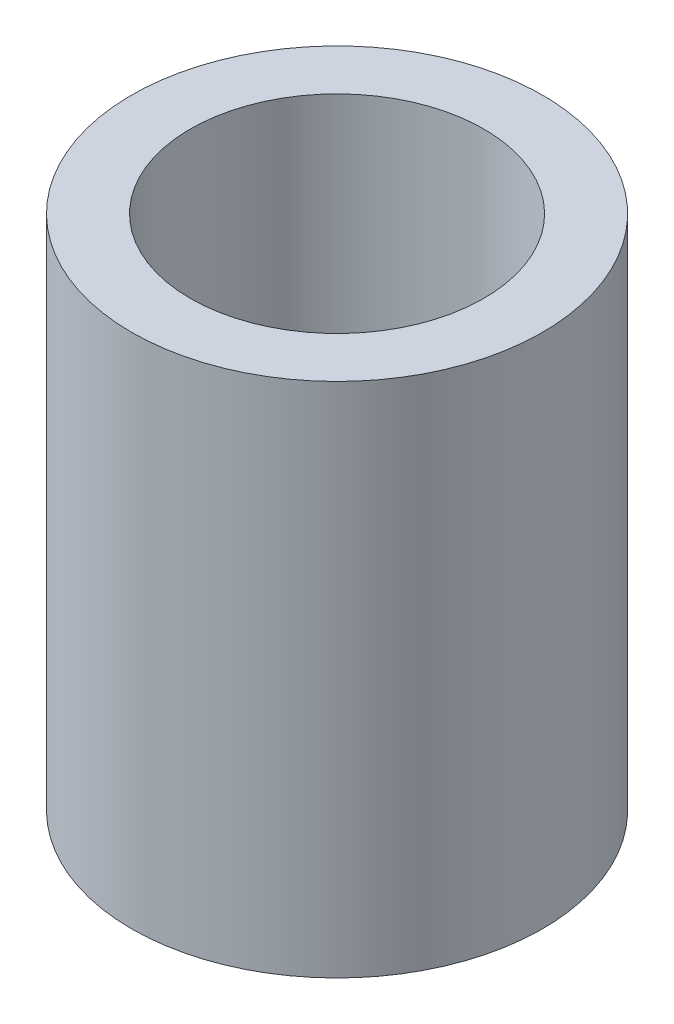
ISO-10303-21;
HEADER;
FILE_DESCRIPTION(('STEP AP214'),'2;1');
FILE_NAME('part.step','',(''),(''),'','','');
FILE_SCHEMA(('AUTOMOTIVE_DESIGN { 1 0 10303 214 1 1 1 1 }'));
ENDSEC;
DATA;
#1=APPLICATION_CONTEXT('core data for automotive mechanical design processes');
#2=APPLICATION_PROTOCOL_DEFINITION('international standard','automotive_design',2000,#1);
#3=PRODUCT_CONTEXT('',#1,'mechanical');
#4=PRODUCT('Part','Part','',(#3));
#5=PRODUCT_RELATED_PRODUCT_CATEGORY('part','',(#4));
#6=PRODUCT_DEFINITION_FORMATION('','',#4);
#7=PRODUCT_DEFINITION_CONTEXT('part definition',#1,'design');
#8=PRODUCT_DEFINITION('design','',#6,#7);
#9=PRODUCT_DEFINITION_SHAPE('','',#8);
#10=(LENGTH_UNIT() NAMED_UNIT(*) SI_UNIT(.MILLI.,.METRE.));
#11=(NAMED_UNIT(*) PLANE_ANGLE_UNIT() SI_UNIT($,.RADIAN.));
#12=(NAMED_UNIT(*) SI_UNIT($,.STERADIAN.) SOLID_ANGLE_UNIT());
#13=UNCERTAINTY_MEASURE_WITH_UNIT(LENGTH_MEASURE(1.E-05),#10,'distance_accuracy_value','');
#14=(GEOMETRIC_REPRESENTATION_CONTEXT(3) GLOBAL_UNCERTAINTY_ASSIGNED_CONTEXT((#13)) GLOBAL_UNIT_ASSIGNED_CONTEXT((#10,
#11,#12)) REPRESENTATION_CONTEXT('',''));
#15=CARTESIAN_POINT('',(0.,0.,0.));
#16=DIRECTION('',(0.,0.,1.));
#17=DIRECTION('',(1.,0.,0.));
#18=AXIS2_PLACEMENT_3D('',#15,#16,#17);
#19=CARTESIAN_POINT('',(0.,-13.97,0.));
#20=DIRECTION('',(0.,1.,0.));
#21=DIRECTION('',(0.,0.,1.));
#22=AXIS2_PLACEMENT_3D('',#19,#20,#21);
#23=CYLINDRICAL_SURFACE('',#22,5.55625);
#24=CARTESIAN_POINT('',(0.,-13.97,0.));
#25=DIRECTION('',(0.,1.,0.));
#26=DIRECTION('',(0.,0.,1.));
#27=AXIS2_PLACEMENT_3D('',#24,#25,#26);
#28=CIRCLE('',#27,5.55625);
#29=CARTESIAN_POINT('',(0.,-13.97,5.55625));
#30=VERTEX_POINT('',#29);
#31=EDGE_CURVE('E10',#30,#30,#28,.T.);
#32=ORIENTED_EDGE('',*,*,#31,.T.);
#33=EDGE_LOOP('',(#32));
#34=FACE_BOUND('',#33,.T.);
#35=CARTESIAN_POINT('',(0.,0.,0.));
#36=DIRECTION('',(0.,1.,0.));
#37=DIRECTION('',(0.,0.,1.));
#38=AXIS2_PLACEMENT_3D('',#35,#36,#37);
#39=CIRCLE('',#38,5.55625);
#40=CARTESIAN_POINT('',(0.,0.,5.55625));
#41=VERTEX_POINT('',#40);
#42=EDGE_CURVE('E40',#41,#41,#39,.T.);
#43=ORIENTED_EDGE('',*,*,#42,.F.);
#44=EDGE_LOOP('',(#43));
#45=FACE_BOUND('',#44,.T.);
#46=ADVANCED_FACE('F37',(#34,#45),#23,.T.);
#47=CARTESIAN_POINT('',(0.,-13.97,0.));
#48=DIRECTION('',(0.,1.,0.));
#49=DIRECTION('',(0.,0.,1.));
#50=AXIS2_PLACEMENT_3D('',#47,#48,#49);
#51=PLANE('',#50);
#52=CARTESIAN_POINT('',(0.,-13.97,0.));
#53=DIRECTION('',(0.,1.,0.));
#54=DIRECTION('',(0.,0.,1.));
#55=AXIS2_PLACEMENT_3D('',#52,#53,#54);
#56=CIRCLE('',#55,3.96875);
#57=CARTESIAN_POINT('',(0.,-13.97,3.96875));
#58=VERTEX_POINT('',#57);
#59=EDGE_CURVE('E49',#58,#58,#56,.T.);
#60=ORIENTED_EDGE('',*,*,#59,.T.);
#61=EDGE_LOOP('',(#60));
#62=FACE_BOUND('',#61,.T.);
#63=ORIENTED_EDGE('',*,*,#31,.F.);
#64=EDGE_LOOP('',(#63));
#65=FACE_BOUND('',#64,.T.);
#66=ADVANCED_FACE('F59',(#62,#65),#51,.F.);
#67=CARTESIAN_POINT('',(0.,0.,0.));
#68=DIRECTION('',(0.,1.,0.));
#69=DIRECTION('',(0.,0.,1.));
#70=AXIS2_PLACEMENT_3D('',#67,#68,#69);
#71=PLANE('',#70);
#72=CARTESIAN_POINT('',(0.,0.,0.));
#73=DIRECTION('',(0.,1.,0.));
#74=DIRECTION('',(0.,0.,1.));
#75=AXIS2_PLACEMENT_3D('',#72,#73,#74);
#76=CIRCLE('',#75,3.96875);
#77=CARTESIAN_POINT('',(0.,0.,3.96875));
#78=VERTEX_POINT('',#77);
#79=EDGE_CURVE('E51',#78,#78,#76,.T.);
#80=ORIENTED_EDGE('',*,*,#79,.F.);
#81=EDGE_LOOP('',(#80));
#82=FACE_BOUND('',#81,.T.);
#83=ORIENTED_EDGE('',*,*,#42,.T.);
#84=EDGE_LOOP('',(#83));
#85=FACE_BOUND('',#84,.T.);
#86=ADVANCED_FACE('F65',(#82,#85),#71,.T.);
#87=CARTESIAN_POINT('',(0.,-13.97,0.));
#88=DIRECTION('',(0.,1.,0.));
#89=DIRECTION('',(0.,0.,1.));
#90=AXIS2_PLACEMENT_3D('',#87,#88,#89);
#91=CYLINDRICAL_SURFACE('',#90,3.96875);
#92=ORIENTED_EDGE('',*,*,#59,.F.);
#93=EDGE_LOOP('',(#92));
#94=FACE_BOUND('',#93,.T.);
#95=ORIENTED_EDGE('',*,*,#79,.T.);
#96=EDGE_LOOP('',(#95));
#97=FACE_BOUND('',#96,.T.);
#98=ADVANCED_FACE('F62',(#94,#97),#91,.F.);
#99=CLOSED_SHELL('',(#46,#66,#86,#98));
#100=MANIFOLD_SOLID_BREP('B2',#99);
#101=ADVANCED_BREP_SHAPE_REPRESENTATION('',(#18,#100),#14);
#102=SHAPE_DEFINITION_REPRESENTATION(#9,#101);
ENDSEC;
END-ISO-10303-21;
